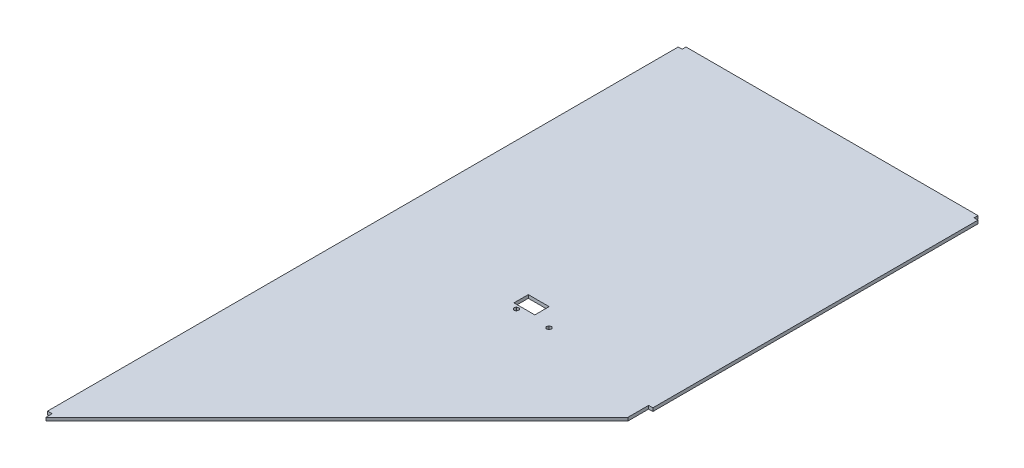
ISO-10303-21;
HEADER;
FILE_DESCRIPTION(('STEP AP214'),'2;1');
FILE_NAME('part.step','',(''),(''),'','','');
FILE_SCHEMA(('AUTOMOTIVE_DESIGN { 1 0 10303 214 1 1 1 1 }'));
ENDSEC;
DATA;
#1=APPLICATION_CONTEXT('core data for automotive mechanical design processes');
#2=APPLICATION_PROTOCOL_DEFINITION('international standard','automotive_design',2000,#1);
#3=PRODUCT_CONTEXT('',#1,'mechanical');
#4=PRODUCT('Part','Part','',(#3));
#5=PRODUCT_RELATED_PRODUCT_CATEGORY('part','',(#4));
#6=PRODUCT_DEFINITION_FORMATION('','',#4);
#7=PRODUCT_DEFINITION_CONTEXT('part definition',#1,'design');
#8=PRODUCT_DEFINITION('design','',#6,#7);
#9=PRODUCT_DEFINITION_SHAPE('','',#8);
#10=(LENGTH_UNIT() NAMED_UNIT(*) SI_UNIT(.MILLI.,.METRE.));
#11=(NAMED_UNIT(*) PLANE_ANGLE_UNIT() SI_UNIT($,.RADIAN.));
#12=(NAMED_UNIT(*) SI_UNIT($,.STERADIAN.) SOLID_ANGLE_UNIT());
#13=UNCERTAINTY_MEASURE_WITH_UNIT(LENGTH_MEASURE(1.E-05),#10,'distance_accuracy_value','');
#14=(GEOMETRIC_REPRESENTATION_CONTEXT(3) GLOBAL_UNCERTAINTY_ASSIGNED_CONTEXT((#13)) GLOBAL_UNIT_ASSIGNED_CONTEXT((#10,
#11,#12)) REPRESENTATION_CONTEXT('',''));
#15=CARTESIAN_POINT('',(0.,0.,0.));
#16=DIRECTION('',(0.,0.,1.));
#17=DIRECTION('',(1.,0.,0.));
#18=AXIS2_PLACEMENT_3D('',#15,#16,#17);
#19=CARTESIAN_POINT('',(230.,0.,495.));
#20=DIRECTION('',(0.,1.,0.));
#21=DIRECTION('',(1.,0.,0.));
#22=AXIS2_PLACEMENT_3D('',#19,#20,#21);
#23=PLANE('',#22);
#24=DIRECTION('',(-0.711201456770069,0.,-0.702988255867858));
#25=VECTOR('',#24,1.);
#26=CARTESIAN_POINT('',(220.380798022758,0.,479.242325743525));
#27=LINE('',#26,#25);
#28=CARTESIAN_POINT('',(223.049778314101,0.,481.880483725481));
#29=VERTEX_POINT('',#28);
#30=CARTESIAN_POINT('',(220.380798022758,0.,479.242325743525));
#31=VERTEX_POINT('',#30);
#32=EDGE_CURVE('E11',#29,#31,#27,.T.);
#33=ORIENTED_EDGE('',*,*,#32,.F.);
#34=DIRECTION('',(-0.964406416528712,0.,0.264424400837457));
#35=VECTOR('',#34,1.);
#36=CARTESIAN_POINT('',(223.049778314101,0.,481.880483725481));
#37=LINE('',#36,#35);
#38=CARTESIAN_POINT('',(226.668980291343,0.,480.888157981956));
#39=VERTEX_POINT('',#38);
#40=EDGE_CURVE('E24',#39,#29,#37,.T.);
#41=ORIENTED_EDGE('',*,*,#40,.F.);
#42=DIRECTION('',(-0.253204959758634,0.,0.967412656705311));
#43=VECTOR('',#42,1.);
#44=CARTESIAN_POINT('',(226.668980291343,0.,480.888157981956));
#45=LINE('',#44,#43);
#46=CARTESIAN_POINT('',(227.619201977242,0.,477.257674256475));
#47=VERTEX_POINT('',#46);
#48=EDGE_CURVE('E449',#47,#39,#45,.T.);
#49=ORIENTED_EDGE('',*,*,#48,.F.);
#50=DIRECTION('',(0.711201456770069,0.,0.702988255867858));
#51=VECTOR('',#50,1.);
#52=CARTESIAN_POINT('',(227.619201977242,0.,477.257674256475));
#53=LINE('',#52,#51);
#54=CARTESIAN_POINT('',(224.950221685899,0.,474.619516274519));
#55=VERTEX_POINT('',#54);
#56=EDGE_CURVE('E444',#55,#47,#53,.T.);
#57=ORIENTED_EDGE('',*,*,#56,.F.);
#58=DIRECTION('',(0.964406416528712,0.,-0.264424400837457));
#59=VECTOR('',#58,1.);
#60=CARTESIAN_POINT('',(224.950221685899,0.,474.619516274519));
#61=LINE('',#60,#59);
#62=CARTESIAN_POINT('',(221.331019708657,0.,475.611842018044));
#63=VERTEX_POINT('',#62);
#64=EDGE_CURVE('E439',#63,#55,#61,.T.);
#65=ORIENTED_EDGE('',*,*,#64,.F.);
#66=DIRECTION('',(0.253204959758634,0.,-0.967412656705311));
#67=VECTOR('',#66,1.);
#68=CARTESIAN_POINT('',(221.331019708657,0.,475.611842018044));
#69=LINE('',#68,#67);
#70=EDGE_CURVE('E434',#31,#63,#69,.T.);
#71=ORIENTED_EDGE('',*,*,#70,.F.);
#72=EDGE_LOOP('',(#33,#41,#49,#57,#65,#71));
#73=FACE_BOUND('',#72,.T.);
#74=DIRECTION('',(-0.711201456770078,0.,-0.702988255867848));
#75=VECTOR('',#74,1.);
#76=CARTESIAN_POINT('',(270.380798022758,0.,479.242325743525));
#77=LINE('',#76,#75);
#78=CARTESIAN_POINT('',(273.049778314101,0.,481.880483725481));
#79=VERTEX_POINT('',#78);
#80=CARTESIAN_POINT('',(270.380798022758,0.,479.242325743525));
#81=VERTEX_POINT('',#80);
#82=EDGE_CURVE('E429',#79,#81,#77,.T.);
#83=ORIENTED_EDGE('',*,*,#82,.F.);
#84=DIRECTION('',(-0.964406416528698,0.,0.26442440083751));
#85=VECTOR('',#84,1.);
#86=CARTESIAN_POINT('',(273.049778314101,0.,481.880483725481));
#87=LINE('',#86,#85);
#88=CARTESIAN_POINT('',(276.668980291343,0.,480.888157981956));
#89=VERTEX_POINT('',#88);
#90=EDGE_CURVE('E424',#89,#79,#87,.T.);
#91=ORIENTED_EDGE('',*,*,#90,.F.);
#92=DIRECTION('',(-0.253204959758642,0.,0.967412656705309));
#93=VECTOR('',#92,1.);
#94=CARTESIAN_POINT('',(276.668980291343,0.,480.888157981956));
#95=LINE('',#94,#93);
#96=CARTESIAN_POINT('',(277.619201977242,0.,477.257674256475));
#97=VERTEX_POINT('',#96);
#98=EDGE_CURVE('E419',#97,#89,#95,.T.);
#99=ORIENTED_EDGE('',*,*,#98,.F.);
#100=DIRECTION('',(0.711201456770092,0.,0.702988255867834));
#101=VECTOR('',#100,1.);
#102=CARTESIAN_POINT('',(277.619201977242,0.,477.257674256475));
#103=LINE('',#102,#101);
#104=CARTESIAN_POINT('',(274.950221685899,0.,474.619516274519));
#105=VERTEX_POINT('',#104);
#106=EDGE_CURVE('E414',#105,#97,#103,.T.);
#107=ORIENTED_EDGE('',*,*,#106,.F.);
#108=DIRECTION('',(0.964406416528705,0.,-0.264424400837484));
#109=VECTOR('',#108,1.);
#110=CARTESIAN_POINT('',(274.950221685899,0.,474.619516274519));
#111=LINE('',#110,#109);
#112=CARTESIAN_POINT('',(271.331019708657,0.,475.611842018044));
#113=VERTEX_POINT('',#112);
#114=EDGE_CURVE('E409',#113,#105,#111,.T.);
#115=ORIENTED_EDGE('',*,*,#114,.F.);
#116=DIRECTION('',(0.25320495975862,0.,-0.967412656705315));
#117=VECTOR('',#116,1.);
#118=CARTESIAN_POINT('',(271.331019708657,0.,475.611842018044));
#119=LINE('',#118,#117);
#120=EDGE_CURVE('E404',#81,#113,#119,.T.);
#121=ORIENTED_EDGE('',*,*,#120,.F.);
#122=EDGE_LOOP('',(#83,#91,#99,#107,#115,#121));
#123=FACE_BOUND('',#122,.T.);
#124=DIRECTION('',(0.,0.,-1.));
#125=VECTOR('',#124,1.);
#126=CARTESIAN_POINT('',(214.,0.,450.));
#127=LINE('',#126,#125);
#128=CARTESIAN_POINT('',(214.,0.,472.));
#129=VERTEX_POINT('',#128);
#130=CARTESIAN_POINT('',(214.,0.,450.));
#131=VERTEX_POINT('',#130);
#132=EDGE_CURVE('E399',#129,#131,#127,.T.);
#133=ORIENTED_EDGE('',*,*,#132,.F.);
#134=DIRECTION('',(-1.,0.,0.));
#135=VECTOR('',#134,1.);
#136=CARTESIAN_POINT('',(214.,0.,472.));
#137=LINE('',#136,#135);
#138=CARTESIAN_POINT('',(246.,0.,472.));
#139=VERTEX_POINT('',#138);
#140=EDGE_CURVE('E394',#139,#129,#137,.T.);
#141=ORIENTED_EDGE('',*,*,#140,.F.);
#142=DIRECTION('',(0.,0.,1.));
#143=VECTOR('',#142,1.);
#144=CARTESIAN_POINT('',(246.,0.,472.));
#145=LINE('',#144,#143);
#146=CARTESIAN_POINT('',(246.,0.,450.));
#147=VERTEX_POINT('',#146);
#148=EDGE_CURVE('E389',#147,#139,#145,.T.);
#149=ORIENTED_EDGE('',*,*,#148,.F.);
#150=DIRECTION('',(1.,0.,0.));
#151=VECTOR('',#150,1.);
#152=CARTESIAN_POINT('',(246.,0.,450.));
#153=LINE('',#152,#151);
#154=EDGE_CURVE('E384',#131,#147,#153,.T.);
#155=ORIENTED_EDGE('',*,*,#154,.F.);
#156=EDGE_LOOP('',(#133,#141,#149,#155));
#157=FACE_BOUND('',#156,.T.);
#158=DIRECTION('',(-1.,0.,0.));
#159=VECTOR('',#158,1.);
#160=CARTESIAN_POINT('',(7.,0.,973.5));
#161=LINE('',#160,#159);
#162=CARTESIAN_POINT('',(7.,0.,973.5));
#163=VERTEX_POINT('',#162);
#164=CARTESIAN_POINT('',(0.,0.,973.5));
#165=VERTEX_POINT('',#164);
#166=EDGE_CURVE('E380',#163,#165,#161,.T.);
#167=ORIENTED_EDGE('',*,*,#166,.T.);
#168=DIRECTION('',(0.,0.,1.));
#169=VECTOR('',#168,1.);
#170=CARTESIAN_POINT('',(0.,0.,0.));
#171=LINE('',#170,#169);
#172=CARTESIAN_POINT('',(0.,0.,6.));
#173=VERTEX_POINT('',#172);
#174=EDGE_CURVE('E221',#173,#165,#171,.T.);
#175=ORIENTED_EDGE('',*,*,#174,.F.);
#176=DIRECTION('',(-1.,0.,0.));
#177=VECTOR('',#176,1.);
#178=CARTESIAN_POINT('',(6.,0.,6.));
#179=LINE('',#178,#177);
#180=CARTESIAN_POINT('',(6.,0.,6.));
#181=VERTEX_POINT('',#180);
#182=EDGE_CURVE('E372',#181,#173,#179,.T.);
#183=ORIENTED_EDGE('',*,*,#182,.F.);
#184=DIRECTION('',(0.,0.,1.));
#185=VECTOR('',#184,1.);
#186=CARTESIAN_POINT('',(6.,0.,0.));
#187=LINE('',#186,#185);
#188=CARTESIAN_POINT('',(6.,0.,0.));
#189=VERTEX_POINT('',#188);
#190=EDGE_CURVE('E367',#189,#181,#187,.T.);
#191=ORIENTED_EDGE('',*,*,#190,.F.);
#192=DIRECTION('',(1.,0.,0.));
#193=VECTOR('',#192,1.);
#194=CARTESIAN_POINT('',(0.,0.,0.));
#195=LINE('',#194,#193);
#196=CARTESIAN_POINT('',(454.,0.,0.));
#197=VERTEX_POINT('',#196);
#198=EDGE_CURVE('E363',#189,#197,#195,.T.);
#199=ORIENTED_EDGE('',*,*,#198,.T.);
#200=DIRECTION('',(0.,0.,1.));
#201=VECTOR('',#200,1.);
#202=CARTESIAN_POINT('',(454.,0.,0.));
#203=LINE('',#202,#201);
#204=CARTESIAN_POINT('',(454.,0.,6.));
#205=VERTEX_POINT('',#204);
#206=EDGE_CURVE('E361',#197,#205,#203,.T.);
#207=ORIENTED_EDGE('',*,*,#206,.T.);
#208=DIRECTION('',(1.,0.,0.));
#209=VECTOR('',#208,1.);
#210=CARTESIAN_POINT('',(230.,0.,6.));
#211=LINE('',#210,#209);
#212=CARTESIAN_POINT('',(460.,0.,6.));
#213=VERTEX_POINT('',#212);
#214=EDGE_CURVE('E357',#205,#213,#211,.T.);
#215=ORIENTED_EDGE('',*,*,#214,.T.);
#216=DIRECTION('',(0.,0.,1.));
#217=VECTOR('',#216,1.);
#218=CARTESIAN_POINT('',(460.,0.,0.));
#219=LINE('',#218,#217);
#220=CARTESIAN_POINT('',(460.,0.,504.895266744439));
#221=VERTEX_POINT('',#220);
#222=EDGE_CURVE('E353',#213,#221,#219,.T.);
#223=ORIENTED_EDGE('',*,*,#222,.T.);
#224=DIRECTION('',(-1.,0.,0.));
#225=VECTOR('',#224,1.);
#226=CARTESIAN_POINT('',(460.000293504121,0.,504.895266744439));
#227=LINE('',#226,#225);
#228=CARTESIAN_POINT('',(453.500098930069,0.,504.895266744439));
#229=VERTEX_POINT('',#228);
#230=EDGE_CURVE('E349',#221,#229,#227,.T.);
#231=ORIENTED_EDGE('',*,*,#230,.T.);
#232=DIRECTION('',(0.,0.,1.));
#233=VECTOR('',#232,1.);
#234=CARTESIAN_POINT('',(453.500098930069,0.,504.895266744439));
#235=LINE('',#234,#233);
#236=CARTESIAN_POINT('',(453.500098930069,0.,536.499901069931));
#237=VERTEX_POINT('',#236);
#238=EDGE_CURVE('E345',#229,#237,#235,.T.);
#239=ORIENTED_EDGE('',*,*,#238,.T.);
#240=DIRECTION('',(0.707106781186547,0.,-0.707106781186548));
#241=VECTOR('',#240,1.);
#242=CARTESIAN_POINT('',(0.,0.,990.));
#243=LINE('',#242,#241);
#244=CARTESIAN_POINT('',(7.,0.,983.));
#245=VERTEX_POINT('',#244);
#246=EDGE_CURVE('E340',#245,#237,#243,.T.);
#247=ORIENTED_EDGE('',*,*,#246,.F.);
#248=DIRECTION('',(0.,0.,-1.));
#249=VECTOR('',#248,1.);
#250=CARTESIAN_POINT('',(7.,0.,990.));
#251=LINE('',#250,#249);
#252=EDGE_CURVE('E336',#245,#163,#251,.T.);
#253=ORIENTED_EDGE('',*,*,#252,.T.);
#254=EDGE_LOOP('',(#167,#175,#183,#191,#199,#207,#215,#223,#231,#239,#247,#253));
#255=FACE_BOUND('',#254,.T.);
#256=ADVANCED_FACE('F16',(#73,#123,#157,#255),#23,.F.);
#257=CARTESIAN_POINT('',(230.,5.,495.));
#258=DIRECTION('',(0.,1.,0.));
#259=DIRECTION('',(0.,0.,1.));
#260=AXIS2_PLACEMENT_3D('',#257,#258,#259);
#261=PLANE('',#260);
#262=DIRECTION('',(-0.711201456770069,0.,-0.702988255867858));
#263=VECTOR('',#262,1.);
#264=CARTESIAN_POINT('',(220.380798022758,5.,479.242325743525));
#265=LINE('',#264,#263);
#266=CARTESIAN_POINT('',(223.049778314101,5.,481.880483725481));
#267=VERTEX_POINT('',#266);
#268=CARTESIAN_POINT('',(220.380798022758,5.,479.242325743525));
#269=VERTEX_POINT('',#268);
#270=EDGE_CURVE('E332',#267,#269,#265,.T.);
#271=ORIENTED_EDGE('',*,*,#270,.T.);
#272=DIRECTION('',(0.253204959758634,0.,-0.967412656705311));
#273=VECTOR('',#272,1.);
#274=CARTESIAN_POINT('',(221.331019708657,5.,475.611842018044));
#275=LINE('',#274,#273);
#276=CARTESIAN_POINT('',(221.331019708657,5.,475.611842018044));
#277=VERTEX_POINT('',#276);
#278=EDGE_CURVE('E328',#269,#277,#275,.T.);
#279=ORIENTED_EDGE('',*,*,#278,.T.);
#280=DIRECTION('',(0.964406416528712,0.,-0.264424400837457));
#281=VECTOR('',#280,1.);
#282=CARTESIAN_POINT('',(224.950221685899,5.,474.619516274519));
#283=LINE('',#282,#281);
#284=CARTESIAN_POINT('',(224.950221685899,5.,474.619516274519));
#285=VERTEX_POINT('',#284);
#286=EDGE_CURVE('E324',#277,#285,#283,.T.);
#287=ORIENTED_EDGE('',*,*,#286,.T.);
#288=DIRECTION('',(0.711201456770069,0.,0.702988255867858));
#289=VECTOR('',#288,1.);
#290=CARTESIAN_POINT('',(227.619201977242,5.,477.257674256475));
#291=LINE('',#290,#289);
#292=CARTESIAN_POINT('',(227.619201977242,5.,477.257674256475));
#293=VERTEX_POINT('',#292);
#294=EDGE_CURVE('E320',#285,#293,#291,.T.);
#295=ORIENTED_EDGE('',*,*,#294,.T.);
#296=DIRECTION('',(-0.253204959758634,0.,0.967412656705311));
#297=VECTOR('',#296,1.);
#298=CARTESIAN_POINT('',(226.668980291343,5.,480.888157981956));
#299=LINE('',#298,#297);
#300=CARTESIAN_POINT('',(226.668980291343,5.,480.888157981956));
#301=VERTEX_POINT('',#300);
#302=EDGE_CURVE('E316',#293,#301,#299,.T.);
#303=ORIENTED_EDGE('',*,*,#302,.T.);
#304=DIRECTION('',(-0.964406416528712,0.,0.264424400837457));
#305=VECTOR('',#304,1.);
#306=CARTESIAN_POINT('',(223.049778314101,5.,481.880483725481));
#307=LINE('',#306,#305);
#308=EDGE_CURVE('E312',#301,#267,#307,.T.);
#309=ORIENTED_EDGE('',*,*,#308,.T.);
#310=EDGE_LOOP('',(#271,#279,#287,#295,#303,#309));
#311=FACE_BOUND('',#310,.T.);
#312=DIRECTION('',(-0.711201456770078,0.,-0.702988255867848));
#313=VECTOR('',#312,1.);
#314=CARTESIAN_POINT('',(270.380798022758,5.,479.242325743525));
#315=LINE('',#314,#313);
#316=CARTESIAN_POINT('',(273.049778314101,5.,481.880483725481));
#317=VERTEX_POINT('',#316);
#318=CARTESIAN_POINT('',(270.380798022758,5.,479.242325743525));
#319=VERTEX_POINT('',#318);
#320=EDGE_CURVE('E308',#317,#319,#315,.T.);
#321=ORIENTED_EDGE('',*,*,#320,.T.);
#322=DIRECTION('',(0.25320495975862,0.,-0.967412656705315));
#323=VECTOR('',#322,1.);
#324=CARTESIAN_POINT('',(271.331019708657,5.,475.611842018044));
#325=LINE('',#324,#323);
#326=CARTESIAN_POINT('',(271.331019708657,5.,475.611842018044));
#327=VERTEX_POINT('',#326);
#328=EDGE_CURVE('E304',#319,#327,#325,.T.);
#329=ORIENTED_EDGE('',*,*,#328,.T.);
#330=DIRECTION('',(0.964406416528705,0.,-0.264424400837484));
#331=VECTOR('',#330,1.);
#332=CARTESIAN_POINT('',(274.950221685899,5.,474.619516274519));
#333=LINE('',#332,#331);
#334=CARTESIAN_POINT('',(274.950221685899,5.,474.619516274519));
#335=VERTEX_POINT('',#334);
#336=EDGE_CURVE('E300',#327,#335,#333,.T.);
#337=ORIENTED_EDGE('',*,*,#336,.T.);
#338=DIRECTION('',(0.711201456770092,0.,0.702988255867834));
#339=VECTOR('',#338,1.);
#340=CARTESIAN_POINT('',(277.619201977242,5.,477.257674256475));
#341=LINE('',#340,#339);
#342=CARTESIAN_POINT('',(277.619201977242,5.,477.257674256475));
#343=VERTEX_POINT('',#342);
#344=EDGE_CURVE('E296',#335,#343,#341,.T.);
#345=ORIENTED_EDGE('',*,*,#344,.T.);
#346=DIRECTION('',(-0.253204959758642,0.,0.967412656705309));
#347=VECTOR('',#346,1.);
#348=CARTESIAN_POINT('',(276.668980291343,5.,480.888157981956));
#349=LINE('',#348,#347);
#350=CARTESIAN_POINT('',(276.668980291343,5.,480.888157981956));
#351=VERTEX_POINT('',#350);
#352=EDGE_CURVE('E292',#343,#351,#349,.T.);
#353=ORIENTED_EDGE('',*,*,#352,.T.);
#354=DIRECTION('',(-0.964406416528698,0.,0.26442440083751));
#355=VECTOR('',#354,1.);
#356=CARTESIAN_POINT('',(273.049778314101,5.,481.880483725481));
#357=LINE('',#356,#355);
#358=EDGE_CURVE('E288',#351,#317,#357,.T.);
#359=ORIENTED_EDGE('',*,*,#358,.T.);
#360=EDGE_LOOP('',(#321,#329,#337,#345,#353,#359));
#361=FACE_BOUND('',#360,.T.);
#362=DIRECTION('',(0.,0.,-1.));
#363=VECTOR('',#362,1.);
#364=CARTESIAN_POINT('',(214.,5.,450.));
#365=LINE('',#364,#363);
#366=CARTESIAN_POINT('',(214.,5.,472.));
#367=VERTEX_POINT('',#366);
#368=CARTESIAN_POINT('',(214.,5.,450.));
#369=VERTEX_POINT('',#368);
#370=EDGE_CURVE('E284',#367,#369,#365,.T.);
#371=ORIENTED_EDGE('',*,*,#370,.T.);
#372=DIRECTION('',(1.,0.,0.));
#373=VECTOR('',#372,1.);
#374=CARTESIAN_POINT('',(246.,5.,450.));
#375=LINE('',#374,#373);
#376=CARTESIAN_POINT('',(246.,5.,450.));
#377=VERTEX_POINT('',#376);
#378=EDGE_CURVE('E280',#369,#377,#375,.T.);
#379=ORIENTED_EDGE('',*,*,#378,.T.);
#380=DIRECTION('',(0.,0.,1.));
#381=VECTOR('',#380,1.);
#382=CARTESIAN_POINT('',(246.,5.,472.));
#383=LINE('',#382,#381);
#384=CARTESIAN_POINT('',(246.,5.,472.));
#385=VERTEX_POINT('',#384);
#386=EDGE_CURVE('E276',#377,#385,#383,.T.);
#387=ORIENTED_EDGE('',*,*,#386,.T.);
#388=DIRECTION('',(-1.,0.,0.));
#389=VECTOR('',#388,1.);
#390=CARTESIAN_POINT('',(214.,5.,472.));
#391=LINE('',#390,#389);
#392=EDGE_CURVE('E217',#385,#367,#391,.T.);
#393=ORIENTED_EDGE('',*,*,#392,.T.);
#394=EDGE_LOOP('',(#371,#379,#387,#393));
#395=FACE_BOUND('',#394,.T.);
#396=DIRECTION('',(1.,0.,0.));
#397=VECTOR('',#396,1.);
#398=CARTESIAN_POINT('',(7.,5.,973.5));
#399=LINE('',#398,#397);
#400=CARTESIAN_POINT('',(0.,5.,973.5));
#401=VERTEX_POINT('',#400);
#402=CARTESIAN_POINT('',(7.,5.,973.5));
#403=VERTEX_POINT('',#402);
#404=EDGE_CURVE('E199',#401,#403,#399,.T.);
#405=ORIENTED_EDGE('',*,*,#404,.T.);
#406=DIRECTION('',(0.,0.,1.));
#407=VECTOR('',#406,1.);
#408=CARTESIAN_POINT('',(7.,5.,990.));
#409=LINE('',#408,#407);
#410=CARTESIAN_POINT('',(7.,5.,983.));
#411=VERTEX_POINT('',#410);
#412=EDGE_CURVE('E218',#403,#411,#409,.T.);
#413=ORIENTED_EDGE('',*,*,#412,.T.);
#414=DIRECTION('',(0.707106781186547,0.,-0.707106781186548));
#415=VECTOR('',#414,1.);
#416=CARTESIAN_POINT('',(0.,5.,990.));
#417=LINE('',#416,#415);
#418=CARTESIAN_POINT('',(453.500098930069,5.,536.499901069931));
#419=VERTEX_POINT('',#418);
#420=EDGE_CURVE('E264',#411,#419,#417,.T.);
#421=ORIENTED_EDGE('',*,*,#420,.T.);
#422=DIRECTION('',(0.,0.,-1.));
#423=VECTOR('',#422,1.);
#424=CARTESIAN_POINT('',(453.500098930069,5.,504.895266744439));
#425=LINE('',#424,#423);
#426=CARTESIAN_POINT('',(453.500098930069,5.,504.895266744439));
#427=VERTEX_POINT('',#426);
#428=EDGE_CURVE('E260',#419,#427,#425,.T.);
#429=ORIENTED_EDGE('',*,*,#428,.T.);
#430=DIRECTION('',(1.,0.,0.));
#431=VECTOR('',#430,1.);
#432=CARTESIAN_POINT('',(460.000293504121,5.,504.895266744439));
#433=LINE('',#432,#431);
#434=CARTESIAN_POINT('',(460.,5.,504.895266744439));
#435=VERTEX_POINT('',#434);
#436=EDGE_CURVE('E256',#427,#435,#433,.T.);
#437=ORIENTED_EDGE('',*,*,#436,.T.);
#438=DIRECTION('',(0.,0.,-1.));
#439=VECTOR('',#438,1.);
#440=CARTESIAN_POINT('',(460.,5.,0.));
#441=LINE('',#440,#439);
#442=CARTESIAN_POINT('',(460.,5.,6.));
#443=VERTEX_POINT('',#442);
#444=EDGE_CURVE('E254',#435,#443,#441,.T.);
#445=ORIENTED_EDGE('',*,*,#444,.T.);
#446=DIRECTION('',(-1.,0.,0.));
#447=VECTOR('',#446,1.);
#448=CARTESIAN_POINT('',(230.,5.,6.));
#449=LINE('',#448,#447);
#450=CARTESIAN_POINT('',(454.,5.,6.));
#451=VERTEX_POINT('',#450);
#452=EDGE_CURVE('E250',#443,#451,#449,.T.);
#453=ORIENTED_EDGE('',*,*,#452,.T.);
#454=DIRECTION('',(0.,0.,-1.));
#455=VECTOR('',#454,1.);
#456=CARTESIAN_POINT('',(454.,5.,0.));
#457=LINE('',#456,#455);
#458=CARTESIAN_POINT('',(454.,5.,0.));
#459=VERTEX_POINT('',#458);
#460=EDGE_CURVE('E246',#451,#459,#457,.T.);
#461=ORIENTED_EDGE('',*,*,#460,.T.);
#462=DIRECTION('',(-1.,0.,0.));
#463=VECTOR('',#462,1.);
#464=CARTESIAN_POINT('',(0.,5.,0.));
#465=LINE('',#464,#463);
#466=CARTESIAN_POINT('',(6.,5.,0.));
#467=VERTEX_POINT('',#466);
#468=EDGE_CURVE('E242',#459,#467,#465,.T.);
#469=ORIENTED_EDGE('',*,*,#468,.T.);
#470=DIRECTION('',(0.,0.,1.));
#471=VECTOR('',#470,1.);
#472=CARTESIAN_POINT('',(6.,5.,0.));
#473=LINE('',#472,#471);
#474=CARTESIAN_POINT('',(6.,5.,6.));
#475=VERTEX_POINT('',#474);
#476=EDGE_CURVE('E238',#467,#475,#473,.T.);
#477=ORIENTED_EDGE('',*,*,#476,.T.);
#478=DIRECTION('',(-1.,0.,0.));
#479=VECTOR('',#478,1.);
#480=CARTESIAN_POINT('',(6.,5.,6.));
#481=LINE('',#480,#479);
#482=CARTESIAN_POINT('',(0.,5.,6.));
#483=VERTEX_POINT('',#482);
#484=EDGE_CURVE('E202',#475,#483,#481,.T.);
#485=ORIENTED_EDGE('',*,*,#484,.T.);
#486=DIRECTION('',(0.,0.,1.));
#487=VECTOR('',#486,1.);
#488=CARTESIAN_POINT('',(0.,5.,0.));
#489=LINE('',#488,#487);
#490=EDGE_CURVE('E196',#483,#401,#489,.T.);
#491=ORIENTED_EDGE('',*,*,#490,.T.);
#492=EDGE_LOOP('',(#405,#413,#421,#429,#437,#445,#453,#461,#469,#477,#485,#491));
#493=FACE_BOUND('',#492,.T.);
#494=ADVANCED_FACE('F198',(#311,#361,#395,#493),#261,.T.);
#495=CARTESIAN_POINT('',(0.,0.,973.5));
#496=DIRECTION('',(0.,0.,1.));
#497=DIRECTION('',(1.,0.,0.));
#498=AXIS2_PLACEMENT_3D('',#495,#496,#497);
#499=PLANE('',#498);
#500=ORIENTED_EDGE('',*,*,#166,.F.);
#501=DIRECTION('',(0.,1.,0.));
#502=VECTOR('',#501,1.);
#503=CARTESIAN_POINT('',(7.,0.,973.5));
#504=LINE('',#503,#502);
#505=EDGE_CURVE('E207',#163,#403,#504,.T.);
#506=ORIENTED_EDGE('',*,*,#505,.T.);
#507=ORIENTED_EDGE('',*,*,#404,.F.);
#508=DIRECTION('',(0.,1.,0.));
#509=VECTOR('',#508,1.);
#510=CARTESIAN_POINT('',(0.,0.,973.5));
#511=LINE('',#510,#509);
#512=EDGE_CURVE('E213',#165,#401,#511,.T.);
#513=ORIENTED_EDGE('',*,*,#512,.F.);
#514=EDGE_LOOP('',(#500,#506,#507,#513));
#515=FACE_BOUND('',#514,.T.);
#516=ADVANCED_FACE('F212',(#515),#499,.T.);
#517=CARTESIAN_POINT('',(7.,0.,973.5));
#518=DIRECTION('',(-1.,0.,0.));
#519=DIRECTION('',(0.,0.,1.));
#520=AXIS2_PLACEMENT_3D('',#517,#518,#519);
#521=PLANE('',#520);
#522=ORIENTED_EDGE('',*,*,#252,.F.);
#523=DIRECTION('',(0.,1.,0.));
#524=VECTOR('',#523,1.);
#525=CARTESIAN_POINT('',(7.,0.,983.));
#526=LINE('',#525,#524);
#527=EDGE_CURVE('E222',#245,#411,#526,.T.);
#528=ORIENTED_EDGE('',*,*,#527,.T.);
#529=ORIENTED_EDGE('',*,*,#412,.F.);
#530=ORIENTED_EDGE('',*,*,#505,.F.);
#531=EDGE_LOOP('',(#522,#528,#529,#530));
#532=FACE_BOUND('',#531,.T.);
#533=ADVANCED_FACE('F595',(#532),#521,.T.);
#534=CARTESIAN_POINT('',(7.,0.,983.));
#535=DIRECTION('',(0.707106781186548,0.,0.707106781186547));
#536=DIRECTION('',(0.707106781186547,0.,-0.707106781186548));
#537=AXIS2_PLACEMENT_3D('',#534,#535,#536);
#538=PLANE('',#537);
#539=ORIENTED_EDGE('',*,*,#246,.T.);
#540=DIRECTION('',(0.,1.,0.));
#541=VECTOR('',#540,1.);
#542=CARTESIAN_POINT('',(453.500098930069,0.,536.499901069931));
#543=LINE('',#542,#541);
#544=EDGE_CURVE('E226',#237,#419,#543,.T.);
#545=ORIENTED_EDGE('',*,*,#544,.T.);
#546=ORIENTED_EDGE('',*,*,#420,.F.);
#547=ORIENTED_EDGE('',*,*,#527,.F.);
#548=EDGE_LOOP('',(#539,#545,#546,#547));
#549=FACE_BOUND('',#548,.T.);
#550=ADVANCED_FACE('F586',(#549),#538,.T.);
#551=CARTESIAN_POINT('',(453.500098930069,0.,536.499901069931));
#552=DIRECTION('',(1.,0.,0.));
#553=DIRECTION('',(0.,0.,-1.));
#554=AXIS2_PLACEMENT_3D('',#551,#552,#553);
#555=PLANE('',#554);
#556=ORIENTED_EDGE('',*,*,#238,.F.);
#557=DIRECTION('',(0.,1.,0.));
#558=VECTOR('',#557,1.);
#559=CARTESIAN_POINT('',(453.500098930069,0.,504.895266744439));
#560=LINE('',#559,#558);
#561=EDGE_CURVE('E572',#229,#427,#560,.T.);
#562=ORIENTED_EDGE('',*,*,#561,.T.);
#563=ORIENTED_EDGE('',*,*,#428,.F.);
#564=ORIENTED_EDGE('',*,*,#544,.F.);
#565=EDGE_LOOP('',(#556,#562,#563,#564));
#566=FACE_BOUND('',#565,.T.);
#567=ADVANCED_FACE('F590',(#566),#555,.T.);
#568=CARTESIAN_POINT('',(453.500098930069,0.,504.895266744439));
#569=DIRECTION('',(0.,0.,1.));
#570=DIRECTION('',(1.,0.,0.));
#571=AXIS2_PLACEMENT_3D('',#568,#569,#570);
#572=PLANE('',#571);
#573=ORIENTED_EDGE('',*,*,#230,.F.);
#574=DIRECTION('',(0.,1.,0.));
#575=VECTOR('',#574,1.);
#576=CARTESIAN_POINT('',(460.,0.,504.895266744439));
#577=LINE('',#576,#575);
#578=EDGE_CURVE('E569',#221,#435,#577,.T.);
#579=ORIENTED_EDGE('',*,*,#578,.T.);
#580=ORIENTED_EDGE('',*,*,#436,.F.);
#581=ORIENTED_EDGE('',*,*,#561,.F.);
#582=EDGE_LOOP('',(#573,#579,#580,#581));
#583=FACE_BOUND('',#582,.T.);
#584=ADVANCED_FACE('F599',(#583),#572,.T.);
#585=CARTESIAN_POINT('',(460.,0.,504.895266744439));
#586=DIRECTION('',(1.,0.,0.));
#587=DIRECTION('',(0.,0.,-1.));
#588=AXIS2_PLACEMENT_3D('',#585,#586,#587);
#589=PLANE('',#588);
#590=ORIENTED_EDGE('',*,*,#222,.F.);
#591=DIRECTION('',(0.,1.,0.));
#592=VECTOR('',#591,1.);
#593=CARTESIAN_POINT('',(460.,0.,6.));
#594=LINE('',#593,#592);
#595=EDGE_CURVE('E566',#213,#443,#594,.T.);
#596=ORIENTED_EDGE('',*,*,#595,.T.);
#597=ORIENTED_EDGE('',*,*,#444,.F.);
#598=ORIENTED_EDGE('',*,*,#578,.F.);
#599=EDGE_LOOP('',(#590,#596,#597,#598));
#600=FACE_BOUND('',#599,.T.);
#601=ADVANCED_FACE('F604',(#600),#589,.T.);
#602=CARTESIAN_POINT('',(6.,0.,6.));
#603=DIRECTION('',(0.,0.,-1.));
#604=DIRECTION('',(-1.,0.,0.));
#605=AXIS2_PLACEMENT_3D('',#602,#603,#604);
#606=PLANE('',#605);
#607=ORIENTED_EDGE('',*,*,#214,.F.);
#608=DIRECTION('',(0.,1.,0.));
#609=VECTOR('',#608,1.);
#610=CARTESIAN_POINT('',(454.,0.,6.));
#611=LINE('',#610,#609);
#612=EDGE_CURVE('E561',#205,#451,#611,.T.);
#613=ORIENTED_EDGE('',*,*,#612,.T.);
#614=ORIENTED_EDGE('',*,*,#452,.F.);
#615=ORIENTED_EDGE('',*,*,#595,.F.);
#616=EDGE_LOOP('',(#607,#613,#614,#615));
#617=FACE_BOUND('',#616,.T.);
#618=ADVANCED_FACE('F611',(#617),#606,.T.);
#619=CARTESIAN_POINT('',(454.,0.,6.));
#620=DIRECTION('',(1.,0.,0.));
#621=DIRECTION('',(0.,0.,-1.));
#622=AXIS2_PLACEMENT_3D('',#619,#620,#621);
#623=PLANE('',#622);
#624=ORIENTED_EDGE('',*,*,#206,.F.);
#625=DIRECTION('',(0.,1.,0.));
#626=VECTOR('',#625,1.);
#627=CARTESIAN_POINT('',(454.,0.,0.));
#628=LINE('',#627,#626);
#629=EDGE_CURVE('E556',#197,#459,#628,.T.);
#630=ORIENTED_EDGE('',*,*,#629,.T.);
#631=ORIENTED_EDGE('',*,*,#460,.F.);
#632=ORIENTED_EDGE('',*,*,#612,.F.);
#633=EDGE_LOOP('',(#624,#630,#631,#632));
#634=FACE_BOUND('',#633,.T.);
#635=ADVANCED_FACE('F614',(#634),#623,.T.);
#636=CARTESIAN_POINT('',(454.,0.,0.));
#637=DIRECTION('',(0.,0.,-1.));
#638=DIRECTION('',(-1.,0.,0.));
#639=AXIS2_PLACEMENT_3D('',#636,#637,#638);
#640=PLANE('',#639);
#641=ORIENTED_EDGE('',*,*,#198,.F.);
#642=DIRECTION('',(0.,1.,0.));
#643=VECTOR('',#642,1.);
#644=CARTESIAN_POINT('',(6.,0.,0.));
#645=LINE('',#644,#643);
#646=EDGE_CURVE('E551',#189,#467,#645,.T.);
#647=ORIENTED_EDGE('',*,*,#646,.T.);
#648=ORIENTED_EDGE('',*,*,#468,.F.);
#649=ORIENTED_EDGE('',*,*,#629,.F.);
#650=EDGE_LOOP('',(#641,#647,#648,#649));
#651=FACE_BOUND('',#650,.T.);
#652=ADVANCED_FACE('F619',(#651),#640,.T.);
#653=CARTESIAN_POINT('',(6.,0.,0.));
#654=DIRECTION('',(-1.,0.,0.));
#655=DIRECTION('',(0.,0.,1.));
#656=AXIS2_PLACEMENT_3D('',#653,#654,#655);
#657=PLANE('',#656);
#658=ORIENTED_EDGE('',*,*,#190,.T.);
#659=DIRECTION('',(0.,1.,0.));
#660=VECTOR('',#659,1.);
#661=CARTESIAN_POINT('',(6.,0.,6.));
#662=LINE('',#661,#660);
#663=EDGE_CURVE('E546',#181,#475,#662,.T.);
#664=ORIENTED_EDGE('',*,*,#663,.T.);
#665=ORIENTED_EDGE('',*,*,#476,.F.);
#666=ORIENTED_EDGE('',*,*,#646,.F.);
#667=EDGE_LOOP('',(#658,#664,#665,#666));
#668=FACE_BOUND('',#667,.T.);
#669=ADVANCED_FACE('F624',(#668),#657,.T.);
#670=ORIENTED_EDGE('',*,*,#182,.T.);
#671=DIRECTION('',(0.,1.,0.));
#672=VECTOR('',#671,1.);
#673=CARTESIAN_POINT('',(0.,0.,6.));
#674=LINE('',#673,#672);
#675=EDGE_CURVE('E542',#173,#483,#674,.T.);
#676=ORIENTED_EDGE('',*,*,#675,.T.);
#677=ORIENTED_EDGE('',*,*,#484,.F.);
#678=ORIENTED_EDGE('',*,*,#663,.F.);
#679=EDGE_LOOP('',(#670,#676,#677,#678));
#680=FACE_BOUND('',#679,.T.);
#681=ADVANCED_FACE('F626',(#680),#606,.T.);
#682=CARTESIAN_POINT('',(0.,0.,6.));
#683=DIRECTION('',(-1.,0.,0.));
#684=DIRECTION('',(0.,0.,1.));
#685=AXIS2_PLACEMENT_3D('',#682,#683,#684);
#686=PLANE('',#685);
#687=ORIENTED_EDGE('',*,*,#174,.T.);
#688=ORIENTED_EDGE('',*,*,#512,.T.);
#689=ORIENTED_EDGE('',*,*,#490,.F.);
#690=ORIENTED_EDGE('',*,*,#675,.F.);
#691=EDGE_LOOP('',(#687,#688,#689,#690));
#692=FACE_BOUND('',#691,.T.);
#693=ADVANCED_FACE('F220',(#692),#686,.T.);
#694=CARTESIAN_POINT('',(214.,0.,472.));
#695=DIRECTION('',(1.,0.,0.));
#696=DIRECTION('',(0.,0.,-1.));
#697=AXIS2_PLACEMENT_3D('',#694,#695,#696);
#698=PLANE('',#697);
#699=ORIENTED_EDGE('',*,*,#132,.T.);
#700=DIRECTION('',(0.,1.,0.));
#701=VECTOR('',#700,1.);
#702=CARTESIAN_POINT('',(214.,0.,450.));
#703=LINE('',#702,#701);
#704=EDGE_CURVE('E537',#131,#369,#703,.T.);
#705=ORIENTED_EDGE('',*,*,#704,.T.);
#706=ORIENTED_EDGE('',*,*,#370,.F.);
#707=DIRECTION('',(0.,1.,0.));
#708=VECTOR('',#707,1.);
#709=CARTESIAN_POINT('',(214.,0.,472.));
#710=LINE('',#709,#708);
#711=EDGE_CURVE('E532',#129,#367,#710,.T.);
#712=ORIENTED_EDGE('',*,*,#711,.F.);
#713=EDGE_LOOP('',(#699,#705,#706,#712));
#714=FACE_BOUND('',#713,.T.);
#715=ADVANCED_FACE('F634',(#714),#698,.T.);
#716=CARTESIAN_POINT('',(214.,0.,450.));
#717=DIRECTION('',(0.,0.,1.));
#718=DIRECTION('',(1.,0.,0.));
#719=AXIS2_PLACEMENT_3D('',#716,#717,#718);
#720=PLANE('',#719);
#721=ORIENTED_EDGE('',*,*,#154,.T.);
#722=DIRECTION('',(0.,1.,0.));
#723=VECTOR('',#722,1.);
#724=CARTESIAN_POINT('',(246.,0.,450.));
#725=LINE('',#724,#723);
#726=EDGE_CURVE('E527',#147,#377,#725,.T.);
#727=ORIENTED_EDGE('',*,*,#726,.T.);
#728=ORIENTED_EDGE('',*,*,#378,.F.);
#729=ORIENTED_EDGE('',*,*,#704,.F.);
#730=EDGE_LOOP('',(#721,#727,#728,#729));
#731=FACE_BOUND('',#730,.T.);
#732=ADVANCED_FACE('F661',(#731),#720,.T.);
#733=CARTESIAN_POINT('',(246.,0.,450.));
#734=DIRECTION('',(-1.,0.,0.));
#735=DIRECTION('',(0.,0.,1.));
#736=AXIS2_PLACEMENT_3D('',#733,#734,#735);
#737=PLANE('',#736);
#738=ORIENTED_EDGE('',*,*,#148,.T.);
#739=DIRECTION('',(0.,1.,0.));
#740=VECTOR('',#739,1.);
#741=CARTESIAN_POINT('',(246.,0.,472.));
#742=LINE('',#741,#740);
#743=EDGE_CURVE('E522',#139,#385,#742,.T.);
#744=ORIENTED_EDGE('',*,*,#743,.T.);
#745=ORIENTED_EDGE('',*,*,#386,.F.);
#746=ORIENTED_EDGE('',*,*,#726,.F.);
#747=EDGE_LOOP('',(#738,#744,#745,#746));
#748=FACE_BOUND('',#747,.T.);
#749=ADVANCED_FACE('F658',(#748),#737,.T.);
#750=CARTESIAN_POINT('',(246.,0.,472.));
#751=DIRECTION('',(0.,0.,-1.));
#752=DIRECTION('',(-1.,0.,0.));
#753=AXIS2_PLACEMENT_3D('',#750,#751,#752);
#754=PLANE('',#753);
#755=ORIENTED_EDGE('',*,*,#140,.T.);
#756=ORIENTED_EDGE('',*,*,#711,.T.);
#757=ORIENTED_EDGE('',*,*,#392,.F.);
#758=ORIENTED_EDGE('',*,*,#743,.F.);
#759=EDGE_LOOP('',(#755,#756,#757,#758));
#760=FACE_BOUND('',#759,.T.);
#761=ADVANCED_FACE('F655',(#760),#754,.T.);
#762=CARTESIAN_POINT('',(273.049778314101,0.,481.880483725481));
#763=DIRECTION('',(0.702988255867848,0.,-0.711201456770078));
#764=DIRECTION('',(-0.711201456770078,0.,-0.702988255867848));
#765=AXIS2_PLACEMENT_3D('',#762,#763,#764);
#766=PLANE('',#765);
#767=ORIENTED_EDGE('',*,*,#82,.T.);
#768=DIRECTION('',(0.,1.,0.));
#769=VECTOR('',#768,1.);
#770=CARTESIAN_POINT('',(270.380798022758,0.,479.242325743525));
#771=LINE('',#770,#769);
#772=EDGE_CURVE('E517',#81,#319,#771,.T.);
#773=ORIENTED_EDGE('',*,*,#772,.T.);
#774=ORIENTED_EDGE('',*,*,#320,.F.);
#775=DIRECTION('',(0.,1.,0.));
#776=VECTOR('',#775,1.);
#777=CARTESIAN_POINT('',(273.049778314101,0.,481.880483725481));
#778=LINE('',#777,#776);
#779=EDGE_CURVE('E512',#79,#317,#778,.T.);
#780=ORIENTED_EDGE('',*,*,#779,.F.);
#781=EDGE_LOOP('',(#767,#773,#774,#780));
#782=FACE_BOUND('',#781,.T.);
#783=ADVANCED_FACE('F729',(#782),#766,.T.);
#784=CARTESIAN_POINT('',(270.380798022758,0.,479.242325743525));
#785=DIRECTION('',(0.967412656705315,0.,0.25320495975862));
#786=DIRECTION('',(0.25320495975862,0.,-0.967412656705315));
#787=AXIS2_PLACEMENT_3D('',#784,#785,#786);
#788=PLANE('',#787);
#789=ORIENTED_EDGE('',*,*,#120,.T.);
#790=DIRECTION('',(0.,1.,0.));
#791=VECTOR('',#790,1.);
#792=CARTESIAN_POINT('',(271.331019708657,0.,475.611842018044));
#793=LINE('',#792,#791);
#794=EDGE_CURVE('E507',#113,#327,#793,.T.);
#795=ORIENTED_EDGE('',*,*,#794,.T.);
#796=ORIENTED_EDGE('',*,*,#328,.F.);
#797=ORIENTED_EDGE('',*,*,#772,.F.);
#798=EDGE_LOOP('',(#789,#795,#796,#797));
#799=FACE_BOUND('',#798,.T.);
#800=ADVANCED_FACE('F737',(#799),#788,.T.);
#801=CARTESIAN_POINT('',(271.331019708657,0.,475.611842018044));
#802=DIRECTION('',(0.264424400837484,0.,0.964406416528705));
#803=DIRECTION('',(0.964406416528705,0.,-0.264424400837484));
#804=AXIS2_PLACEMENT_3D('',#801,#802,#803);
#805=PLANE('',#804);
#806=ORIENTED_EDGE('',*,*,#114,.T.);
#807=DIRECTION('',(0.,1.,0.));
#808=VECTOR('',#807,1.);
#809=CARTESIAN_POINT('',(274.950221685899,0.,474.619516274519));
#810=LINE('',#809,#808);
#811=EDGE_CURVE('E502',#105,#335,#810,.T.);
#812=ORIENTED_EDGE('',*,*,#811,.T.);
#813=ORIENTED_EDGE('',*,*,#336,.F.);
#814=ORIENTED_EDGE('',*,*,#794,.F.);
#815=EDGE_LOOP('',(#806,#812,#813,#814));
#816=FACE_BOUND('',#815,.T.);
#817=ADVANCED_FACE('F747',(#816),#805,.T.);
#818=CARTESIAN_POINT('',(274.950221685899,0.,474.619516274519));
#819=DIRECTION('',(-0.702988255867834,0.,0.711201456770092));
#820=DIRECTION('',(0.711201456770092,0.,0.702988255867834));
#821=AXIS2_PLACEMENT_3D('',#818,#819,#820);
#822=PLANE('',#821);
#823=ORIENTED_EDGE('',*,*,#106,.T.);
#824=DIRECTION('',(0.,1.,0.));
#825=VECTOR('',#824,1.);
#826=CARTESIAN_POINT('',(277.619201977242,0.,477.257674256475));
#827=LINE('',#826,#825);
#828=EDGE_CURVE('E497',#97,#343,#827,.T.);
#829=ORIENTED_EDGE('',*,*,#828,.T.);
#830=ORIENTED_EDGE('',*,*,#344,.F.);
#831=ORIENTED_EDGE('',*,*,#811,.F.);
#832=EDGE_LOOP('',(#823,#829,#830,#831));
#833=FACE_BOUND('',#832,.T.);
#834=ADVANCED_FACE('F757',(#833),#822,.T.);
#835=CARTESIAN_POINT('',(277.619201977242,0.,477.257674256475));
#836=DIRECTION('',(-0.967412656705309,0.,-0.253204959758642));
#837=DIRECTION('',(-0.253204959758642,0.,0.967412656705309));
#838=AXIS2_PLACEMENT_3D('',#835,#836,#837);
#839=PLANE('',#838);
#840=ORIENTED_EDGE('',*,*,#98,.T.);
#841=DIRECTION('',(0.,1.,0.));
#842=VECTOR('',#841,1.);
#843=CARTESIAN_POINT('',(276.668980291343,0.,480.888157981956));
#844=LINE('',#843,#842);
#845=EDGE_CURVE('E492',#89,#351,#844,.T.);
#846=ORIENTED_EDGE('',*,*,#845,.T.);
#847=ORIENTED_EDGE('',*,*,#352,.F.);
#848=ORIENTED_EDGE('',*,*,#828,.F.);
#849=EDGE_LOOP('',(#840,#846,#847,#848));
#850=FACE_BOUND('',#849,.T.);
#851=ADVANCED_FACE('F767',(#850),#839,.T.);
#852=CARTESIAN_POINT('',(276.668980291343,0.,480.888157981956));
#853=DIRECTION('',(-0.26442440083751,0.,-0.964406416528698));
#854=DIRECTION('',(-0.964406416528698,0.,0.26442440083751));
#855=AXIS2_PLACEMENT_3D('',#852,#853,#854);
#856=PLANE('',#855);
#857=ORIENTED_EDGE('',*,*,#90,.T.);
#858=ORIENTED_EDGE('',*,*,#779,.T.);
#859=ORIENTED_EDGE('',*,*,#358,.F.);
#860=ORIENTED_EDGE('',*,*,#845,.F.);
#861=EDGE_LOOP('',(#857,#858,#859,#860));
#862=FACE_BOUND('',#861,.T.);
#863=ADVANCED_FACE('F777',(#862),#856,.T.);
#864=CARTESIAN_POINT('',(223.049778314101,0.,481.880483725481));
#865=DIRECTION('',(0.702988255867858,0.,-0.711201456770069));
#866=DIRECTION('',(-0.711201456770069,0.,-0.702988255867858));
#867=AXIS2_PLACEMENT_3D('',#864,#865,#866);
#868=PLANE('',#867);
#869=ORIENTED_EDGE('',*,*,#32,.T.);
#870=DIRECTION('',(0.,1.,0.));
#871=VECTOR('',#870,1.);
#872=CARTESIAN_POINT('',(220.380798022758,0.,479.242325743525));
#873=LINE('',#872,#871);
#874=EDGE_CURVE('E487',#31,#269,#873,.T.);
#875=ORIENTED_EDGE('',*,*,#874,.T.);
#876=ORIENTED_EDGE('',*,*,#270,.F.);
#877=DIRECTION('',(0.,1.,0.));
#878=VECTOR('',#877,1.);
#879=CARTESIAN_POINT('',(223.049778314101,0.,481.880483725481));
#880=LINE('',#879,#878);
#881=EDGE_CURVE('E462',#29,#267,#880,.T.);
#882=ORIENTED_EDGE('',*,*,#881,.F.);
#883=EDGE_LOOP('',(#869,#875,#876,#882));
#884=FACE_BOUND('',#883,.T.);
#885=ADVANCED_FACE('F787',(#884),#868,.T.);
#886=CARTESIAN_POINT('',(220.380798022758,0.,479.242325743525));
#887=DIRECTION('',(0.967412656705311,0.,0.253204959758634));
#888=DIRECTION('',(0.253204959758634,0.,-0.967412656705311));
#889=AXIS2_PLACEMENT_3D('',#886,#887,#888);
#890=PLANE('',#889);
#891=ORIENTED_EDGE('',*,*,#70,.T.);
#892=DIRECTION('',(0.,1.,0.));
#893=VECTOR('',#892,1.);
#894=CARTESIAN_POINT('',(221.331019708657,0.,475.611842018044));
#895=LINE('',#894,#893);
#896=EDGE_CURVE('E479',#63,#277,#895,.T.);
#897=ORIENTED_EDGE('',*,*,#896,.T.);
#898=ORIENTED_EDGE('',*,*,#278,.F.);
#899=ORIENTED_EDGE('',*,*,#874,.F.);
#900=EDGE_LOOP('',(#891,#897,#898,#899));
#901=FACE_BOUND('',#900,.T.);
#902=ADVANCED_FACE('F797',(#901),#890,.T.);
#903=CARTESIAN_POINT('',(221.331019708657,0.,475.611842018044));
#904=DIRECTION('',(0.264424400837457,0.,0.964406416528712));
#905=DIRECTION('',(0.964406416528712,0.,-0.264424400837457));
#906=AXIS2_PLACEMENT_3D('',#903,#904,#905);
#907=PLANE('',#906);
#908=ORIENTED_EDGE('',*,*,#64,.T.);
#909=DIRECTION('',(0.,1.,0.));
#910=VECTOR('',#909,1.);
#911=CARTESIAN_POINT('',(224.950221685899,0.,474.619516274519));
#912=LINE('',#911,#910);
#913=EDGE_CURVE('E470',#55,#285,#912,.T.);
#914=ORIENTED_EDGE('',*,*,#913,.T.);
#915=ORIENTED_EDGE('',*,*,#286,.F.);
#916=ORIENTED_EDGE('',*,*,#896,.F.);
#917=EDGE_LOOP('',(#908,#914,#915,#916));
#918=FACE_BOUND('',#917,.T.);
#919=ADVANCED_FACE('F807',(#918),#907,.T.);
#920=CARTESIAN_POINT('',(224.950221685899,0.,474.619516274519));
#921=DIRECTION('',(-0.702988255867858,0.,0.711201456770069));
#922=DIRECTION('',(0.711201456770069,0.,0.702988255867858));
#923=AXIS2_PLACEMENT_3D('',#920,#921,#922);
#924=PLANE('',#923);
#925=ORIENTED_EDGE('',*,*,#56,.T.);
#926=DIRECTION('',(0.,1.,0.));
#927=VECTOR('',#926,1.);
#928=CARTESIAN_POINT('',(227.619201977242,0.,477.257674256475));
#929=LINE('',#928,#927);
#930=EDGE_CURVE('E467',#47,#293,#929,.T.);
#931=ORIENTED_EDGE('',*,*,#930,.T.);
#932=ORIENTED_EDGE('',*,*,#294,.F.);
#933=ORIENTED_EDGE('',*,*,#913,.F.);
#934=EDGE_LOOP('',(#925,#931,#932,#933));
#935=FACE_BOUND('',#934,.T.);
#936=ADVANCED_FACE('F817',(#935),#924,.T.);
#937=CARTESIAN_POINT('',(227.619201977242,0.,477.257674256475));
#938=DIRECTION('',(-0.967412656705311,0.,-0.253204959758634));
#939=DIRECTION('',(-0.253204959758634,0.,0.967412656705311));
#940=AXIS2_PLACEMENT_3D('',#937,#938,#939);
#941=PLANE('',#940);
#942=ORIENTED_EDGE('',*,*,#48,.T.);
#943=DIRECTION('',(0.,1.,0.));
#944=VECTOR('',#943,1.);
#945=CARTESIAN_POINT('',(226.668980291343,0.,480.888157981956));
#946=LINE('',#945,#944);
#947=EDGE_CURVE('E464',#39,#301,#946,.T.);
#948=ORIENTED_EDGE('',*,*,#947,.T.);
#949=ORIENTED_EDGE('',*,*,#302,.F.);
#950=ORIENTED_EDGE('',*,*,#930,.F.);
#951=EDGE_LOOP('',(#942,#948,#949,#950));
#952=FACE_BOUND('',#951,.T.);
#953=ADVANCED_FACE('F827',(#952),#941,.T.);
#954=CARTESIAN_POINT('',(226.668980291343,0.,480.888157981956));
#955=DIRECTION('',(-0.264424400837457,0.,-0.964406416528712));
#956=DIRECTION('',(-0.964406416528712,0.,0.264424400837457));
#957=AXIS2_PLACEMENT_3D('',#954,#955,#956);
#958=PLANE('',#957);
#959=ORIENTED_EDGE('',*,*,#40,.T.);
#960=ORIENTED_EDGE('',*,*,#881,.T.);
#961=ORIENTED_EDGE('',*,*,#308,.F.);
#962=ORIENTED_EDGE('',*,*,#947,.F.);
#963=EDGE_LOOP('',(#959,#960,#961,#962));
#964=FACE_BOUND('',#963,.T.);
#965=ADVANCED_FACE('F460',(#964),#958,.T.);
#966=CLOSED_SHELL('',(#256,#494,#516,#533,#550,#567,#584,#601,#618,#635,#652,#669,#681,#693,
#715,#732,#749,#761,#783,#800,#817,#834,#851,#863,#885,#902,#919,#936,#953,#965));
#967=MANIFOLD_SOLID_BREP('B1',#966);
#968=ADVANCED_BREP_SHAPE_REPRESENTATION('',(#18,#967),#14);
#969=SHAPE_DEFINITION_REPRESENTATION(#9,#968);
ENDSEC;
END-ISO-10303-21;
